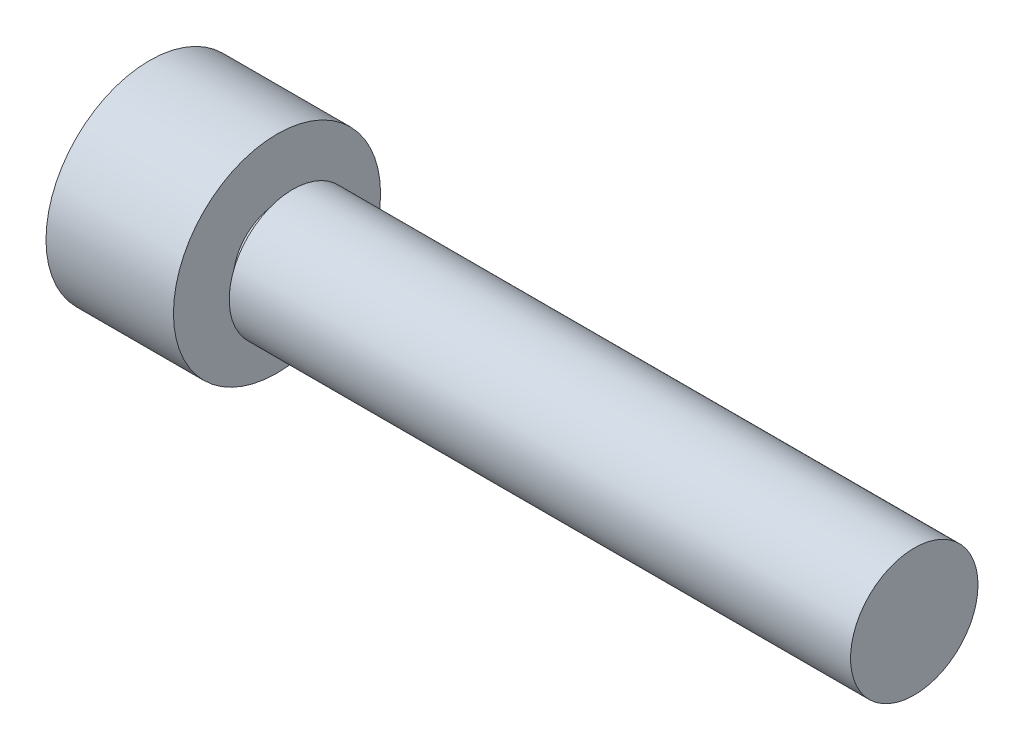
ISO-10303-21;
HEADER;
FILE_DESCRIPTION(('STEP AP214'),'2;1');
FILE_NAME('part.step','',(''),(''),'','','');
FILE_SCHEMA(('AUTOMOTIVE_DESIGN { 1 0 10303 214 1 1 1 1 }'));
ENDSEC;
DATA;
#1=APPLICATION_CONTEXT('core data for automotive mechanical design processes');
#2=APPLICATION_PROTOCOL_DEFINITION('international standard','automotive_design',2000,#1);
#3=PRODUCT_CONTEXT('',#1,'mechanical');
#4=PRODUCT('Part','Part','',(#3));
#5=PRODUCT_RELATED_PRODUCT_CATEGORY('part','',(#4));
#6=PRODUCT_DEFINITION_FORMATION('','',#4);
#7=PRODUCT_DEFINITION_CONTEXT('part definition',#1,'design');
#8=PRODUCT_DEFINITION('design','',#6,#7);
#9=PRODUCT_DEFINITION_SHAPE('','',#8);
#10=(LENGTH_UNIT() NAMED_UNIT(*) SI_UNIT(.MILLI.,.METRE.));
#11=(NAMED_UNIT(*) PLANE_ANGLE_UNIT() SI_UNIT($,.RADIAN.));
#12=(NAMED_UNIT(*) SI_UNIT($,.STERADIAN.) SOLID_ANGLE_UNIT());
#13=UNCERTAINTY_MEASURE_WITH_UNIT(LENGTH_MEASURE(1.E-05),#10,'distance_accuracy_value','');
#14=(GEOMETRIC_REPRESENTATION_CONTEXT(3) GLOBAL_UNCERTAINTY_ASSIGNED_CONTEXT((#13)) GLOBAL_UNIT_ASSIGNED_CONTEXT((#10,
#11,#12)) REPRESENTATION_CONTEXT('',''));
#15=CARTESIAN_POINT('',(0.,0.,0.));
#16=DIRECTION('',(0.,0.,1.));
#17=DIRECTION('',(1.,0.,0.));
#18=AXIS2_PLACEMENT_3D('',#15,#16,#17);
#19=CARTESIAN_POINT('',(0.,0.,0.));
#20=DIRECTION('',(1.,0.,0.));
#21=DIRECTION('',(0.,0.,-1.));
#22=AXIS2_PLACEMENT_3D('',#19,#20,#21);
#23=PLANE('',#22);
#24=CARTESIAN_POINT('',(0.,0.,0.));
#25=DIRECTION('',(1.,0.,0.));
#26=DIRECTION('',(0.,0.,-1.));
#27=AXIS2_PLACEMENT_3D('',#24,#25,#26);
#28=CIRCLE('',#27,4.);
#29=CARTESIAN_POINT('',(0.,0.,-4.));
#30=VERTEX_POINT('',#29);
#31=EDGE_CURVE('E10',#30,#30,#28,.T.);
#32=ORIENTED_EDGE('',*,*,#31,.T.);
#33=EDGE_LOOP('',(#32));
#34=FACE_BOUND('',#33,.T.);
#35=ADVANCED_FACE('F37',(#34),#23,.T.);
#36=CARTESIAN_POINT('',(0.,0.,0.));
#37=DIRECTION('',(1.,0.,0.));
#38=DIRECTION('',(0.,0.,-1.));
#39=AXIS2_PLACEMENT_3D('',#36,#37,#38);
#40=CYLINDRICAL_SURFACE('',#39,4.);
#41=CARTESIAN_POINT('',(-39.,0.,0.));
#42=DIRECTION('',(1.,0.,0.));
#43=DIRECTION('',(0.,0.,-1.));
#44=AXIS2_PLACEMENT_3D('',#41,#42,#43);
#45=CIRCLE('',#44,4.);
#46=CARTESIAN_POINT('',(-39.,0.,-3.99999999999999));
#47=VERTEX_POINT('',#46);
#48=EDGE_CURVE('E44',#47,#47,#45,.T.);
#49=ORIENTED_EDGE('',*,*,#48,.T.);
#50=EDGE_LOOP('',(#49));
#51=FACE_BOUND('',#50,.T.);
#52=ORIENTED_EDGE('',*,*,#31,.F.);
#53=EDGE_LOOP('',(#52));
#54=FACE_BOUND('',#53,.T.);
#55=ADVANCED_FACE('F81',(#51,#54),#40,.T.);
#56=CARTESIAN_POINT('',(-39.,0.,-3.99999999999999));
#57=DIRECTION('',(-1.,0.,0.));
#58=DIRECTION('',(0.,0.,1.));
#59=AXIS2_PLACEMENT_3D('',#56,#57,#58);
#60=PLANE('',#59);
#61=CARTESIAN_POINT('',(-39.,0.,0.));
#62=DIRECTION('',(1.,0.,0.));
#63=DIRECTION('',(0.,0.,-1.));
#64=AXIS2_PLACEMENT_3D('',#61,#62,#63);
#65=CIRCLE('',#64,2.75);
#66=CARTESIAN_POINT('',(-39.,0.,-2.75));
#67=VERTEX_POINT('',#66);
#68=EDGE_CURVE('E49',#67,#67,#65,.T.);
#69=ORIENTED_EDGE('',*,*,#68,.T.);
#70=EDGE_LOOP('',(#69));
#71=FACE_BOUND('',#70,.T.);
#72=ORIENTED_EDGE('',*,*,#48,.F.);
#73=EDGE_LOOP('',(#72));
#74=FACE_BOUND('',#73,.T.);
#75=ADVANCED_FACE('F85',(#71,#74),#60,.T.);
#76=CARTESIAN_POINT('',(0.,0.,0.));
#77=DIRECTION('',(1.,0.,0.));
#78=DIRECTION('',(0.,0.,-1.));
#79=AXIS2_PLACEMENT_3D('',#76,#77,#78);
#80=CYLINDRICAL_SURFACE('',#79,2.75);
#81=CARTESIAN_POINT('',(-40.,0.,0.));
#82=DIRECTION('',(1.,0.,0.));
#83=DIRECTION('',(0.,0.,-1.));
#84=AXIS2_PLACEMENT_3D('',#81,#82,#83);
#85=CIRCLE('',#84,2.75);
#86=CARTESIAN_POINT('',(-40.,0.,-2.75));
#87=VERTEX_POINT('',#86);
#88=EDGE_CURVE('E54',#87,#87,#85,.T.);
#89=ORIENTED_EDGE('',*,*,#88,.T.);
#90=EDGE_LOOP('',(#89));
#91=FACE_BOUND('',#90,.T.);
#92=ORIENTED_EDGE('',*,*,#68,.F.);
#93=EDGE_LOOP('',(#92));
#94=FACE_BOUND('',#93,.T.);
#95=ADVANCED_FACE('F89',(#91,#94),#80,.T.);
#96=CARTESIAN_POINT('',(-40.,0.,-6.49999999999999));
#97=DIRECTION('',(1.,0.,0.));
#98=DIRECTION('',(0.,0.,-1.));
#99=AXIS2_PLACEMENT_3D('',#96,#97,#98);
#100=PLANE('',#99);
#101=CARTESIAN_POINT('',(-40.,0.,0.));
#102=DIRECTION('',(1.,0.,0.));
#103=DIRECTION('',(0.,0.,-1.));
#104=AXIS2_PLACEMENT_3D('',#101,#102,#103);
#105=CIRCLE('',#104,6.5);
#106=CARTESIAN_POINT('',(-40.,0.,-6.49999999999999));
#107=VERTEX_POINT('',#106);
#108=EDGE_CURVE('E60',#107,#107,#105,.T.);
#109=ORIENTED_EDGE('',*,*,#108,.T.);
#110=EDGE_LOOP('',(#109));
#111=FACE_BOUND('',#110,.T.);
#112=ORIENTED_EDGE('',*,*,#88,.F.);
#113=EDGE_LOOP('',(#112));
#114=FACE_BOUND('',#113,.T.);
#115=ADVANCED_FACE('F78',(#111,#114),#100,.T.);
#116=CARTESIAN_POINT('',(0.,0.,0.));
#117=DIRECTION('',(1.,0.,0.));
#118=DIRECTION('',(0.,0.,-1.));
#119=AXIS2_PLACEMENT_3D('',#116,#117,#118);
#120=CYLINDRICAL_SURFACE('',#119,6.5);
#121=CARTESIAN_POINT('',(-48.,0.,0.));
#122=DIRECTION('',(1.,0.,0.));
#123=DIRECTION('',(0.,0.,-1.));
#124=AXIS2_PLACEMENT_3D('',#121,#122,#123);
#125=CIRCLE('',#124,6.5);
#126=CARTESIAN_POINT('',(-48.,0.,-6.49999999999999));
#127=VERTEX_POINT('',#126);
#128=EDGE_CURVE('E64',#127,#127,#125,.T.);
#129=ORIENTED_EDGE('',*,*,#128,.T.);
#130=EDGE_LOOP('',(#129));
#131=FACE_BOUND('',#130,.T.);
#132=ORIENTED_EDGE('',*,*,#108,.F.);
#133=EDGE_LOOP('',(#132));
#134=FACE_BOUND('',#133,.T.);
#135=ADVANCED_FACE('F69',(#131,#134),#120,.T.);
#136=CARTESIAN_POINT('',(-48.,0.,-6.49999999999999));
#137=DIRECTION('',(-1.,0.,0.));
#138=DIRECTION('',(0.,0.,1.));
#139=AXIS2_PLACEMENT_3D('',#136,#137,#138);
#140=PLANE('',#139);
#141=ORIENTED_EDGE('',*,*,#128,.F.);
#142=EDGE_LOOP('',(#141));
#143=FACE_BOUND('',#142,.T.);
#144=ADVANCED_FACE('F72',(#143),#140,.T.);
#145=CLOSED_SHELL('',(#35,#55,#75,#95,#115,#135,#144));
#146=MANIFOLD_SOLID_BREP('B2',#145);
#147=ADVANCED_BREP_SHAPE_REPRESENTATION('',(#18,#146),#14);
#148=SHAPE_DEFINITION_REPRESENTATION(#9,#147);
ENDSEC;
END-ISO-10303-21;
